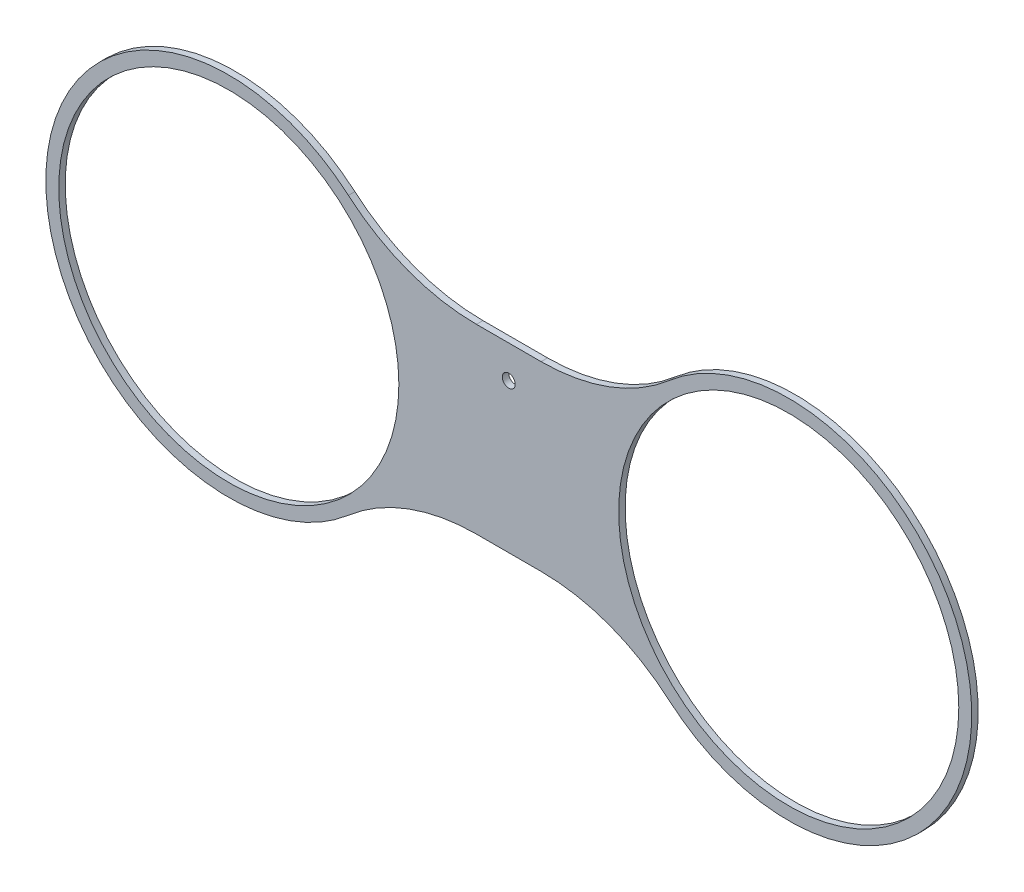
ISO-10303-21;
HEADER;
FILE_DESCRIPTION(('STEP AP214'),'2;1');
FILE_NAME('part.step','',(''),(''),'','','');
FILE_SCHEMA(('AUTOMOTIVE_DESIGN { 1 0 10303 214 1 1 1 1 }'));
ENDSEC;
DATA;
#1=APPLICATION_CONTEXT('core data for automotive mechanical design processes');
#2=APPLICATION_PROTOCOL_DEFINITION('international standard','automotive_design',2000,#1);
#3=PRODUCT_CONTEXT('',#1,'mechanical');
#4=PRODUCT('Part','Part','',(#3));
#5=PRODUCT_RELATED_PRODUCT_CATEGORY('part','',(#4));
#6=PRODUCT_DEFINITION_FORMATION('','',#4);
#7=PRODUCT_DEFINITION_CONTEXT('part definition',#1,'design');
#8=PRODUCT_DEFINITION('design','',#6,#7);
#9=PRODUCT_DEFINITION_SHAPE('','',#8);
#10=(LENGTH_UNIT() NAMED_UNIT(*) SI_UNIT(.MILLI.,.METRE.));
#11=(NAMED_UNIT(*) PLANE_ANGLE_UNIT() SI_UNIT($,.RADIAN.));
#12=(NAMED_UNIT(*) SI_UNIT($,.STERADIAN.) SOLID_ANGLE_UNIT());
#13=UNCERTAINTY_MEASURE_WITH_UNIT(LENGTH_MEASURE(1.E-05),#10,'distance_accuracy_value','');
#14=(GEOMETRIC_REPRESENTATION_CONTEXT(3) GLOBAL_UNCERTAINTY_ASSIGNED_CONTEXT((#13)) GLOBAL_UNIT_ASSIGNED_CONTEXT((#10,
#11,#12)) REPRESENTATION_CONTEXT('',''));
#15=CARTESIAN_POINT('',(0.,0.,0.));
#16=DIRECTION('',(0.,0.,1.));
#17=DIRECTION('',(1.,0.,0.));
#18=AXIS2_PLACEMENT_3D('',#15,#16,#17);
#19=CARTESIAN_POINT('',(15.8526007747352,-140.742861720747,3.175));
#20=DIRECTION('',(0.,0.,1.));
#21=DIRECTION('',(1.,0.,0.));
#22=AXIS2_PLACEMENT_3D('',#19,#20,#21);
#23=PLANE('',#22);
#24=CARTESIAN_POINT('',(-137.421087546888,0.,3.175));
#25=DIRECTION('',(0.,0.,1.));
#26=DIRECTION('',(1.,0.,0.));
#27=AXIS2_PLACEMENT_3D('',#24,#25,#26);
#28=CIRCLE('',#27,83.4771);
#29=CARTESIAN_POINT('',(-53.9439875468881,0.,3.175));
#30=VERTEX_POINT('',#29);
#31=EDGE_CURVE('E181',#30,#30,#28,.T.);
#32=ORIENTED_EDGE('',*,*,#31,.F.);
#33=EDGE_LOOP('',(#32));
#34=FACE_BOUND('',#33,.T.);
#35=CARTESIAN_POINT('',(15.8526007747352,-140.742861720747,3.175));
#36=DIRECTION('',(0.,0.,-1.));
#37=DIRECTION('',(1.,0.,0.));
#38=AXIS2_PLACEMENT_3D('',#35,#36,#37);
#39=CIRCLE('',#38,96.148519688986);
#40=CARTESIAN_POINT('',(15.8526007747352,-44.5943420317607,3.175));
#41=VERTEX_POINT('',#40);
#42=CARTESIAN_POINT('',(78.7018324643302,-67.9794649170588,3.175));
#43=VERTEX_POINT('',#42);
#44=EDGE_CURVE('E144',#41,#43,#39,.T.);
#45=ORIENTED_EDGE('',*,*,#44,.T.);
#46=CARTESIAN_POINT('',(137.418953,0.,3.175));
#47=DIRECTION('',(0.,0.,1.));
#48=DIRECTION('',(1.,0.,0.));
#49=AXIS2_PLACEMENT_3D('',#46,#47,#48);
#50=CIRCLE('',#49,89.8271);
#51=CARTESIAN_POINT('',(78.7018324643302,67.9794649170588,3.175));
#52=VERTEX_POINT('',#51);
#53=EDGE_CURVE('E92',#43,#52,#50,.T.);
#54=ORIENTED_EDGE('',*,*,#53,.T.);
#55=CARTESIAN_POINT('',(15.8526007747352,140.742861720747,3.175));
#56=DIRECTION('',(0.,0.,-1.));
#57=DIRECTION('',(-1.,0.,0.));
#58=AXIS2_PLACEMENT_3D('',#55,#56,#57);
#59=CIRCLE('',#58,96.1485196889861);
#60=CARTESIAN_POINT('',(15.8526007747352,44.5943420317607,3.175));
#61=VERTEX_POINT('',#60);
#62=EDGE_CURVE('E159',#52,#61,#59,.T.);
#63=ORIENTED_EDGE('',*,*,#62,.T.);
#64=DIRECTION('',(-1.,0.,0.));
#65=VECTOR('',#64,1.);
#66=CARTESIAN_POINT('',(15.8526007747352,44.5943420317607,3.175));
#67=LINE('',#66,#65);
#68=CARTESIAN_POINT('',(-15.8547353216234,44.5943420317607,3.175));
#69=VERTEX_POINT('',#68);
#70=EDGE_CURVE('E172',#61,#69,#67,.T.);
#71=ORIENTED_EDGE('',*,*,#70,.T.);
#72=CARTESIAN_POINT('',(-15.8547353216234,140.742861720747,3.175));
#73=DIRECTION('',(0.,0.,-1.));
#74=DIRECTION('',(1.,0.,0.));
#75=AXIS2_PLACEMENT_3D('',#72,#73,#74);
#76=CIRCLE('',#75,96.1485196889861);
#77=CARTESIAN_POINT('',(-78.7039670112184,67.9794649170588,3.175));
#78=VERTEX_POINT('',#77);
#79=EDGE_CURVE('E111',#69,#78,#76,.T.);
#80=ORIENTED_EDGE('',*,*,#79,.T.);
#81=CARTESIAN_POINT('',(-137.421087546888,0.,3.175));
#82=DIRECTION('',(0.,0.,1.));
#83=DIRECTION('',(-1.,0.,0.));
#84=AXIS2_PLACEMENT_3D('',#81,#82,#83);
#85=CIRCLE('',#84,89.8271);
#86=CARTESIAN_POINT('',(-78.7039670112183,-67.9794649170587,3.175));
#87=VERTEX_POINT('',#86);
#88=EDGE_CURVE('E105',#78,#87,#85,.T.);
#89=ORIENTED_EDGE('',*,*,#88,.T.);
#90=CARTESIAN_POINT('',(-15.8547353216234,-140.742861720747,3.175));
#91=DIRECTION('',(0.,0.,-1.));
#92=DIRECTION('',(-1.,0.,0.));
#93=AXIS2_PLACEMENT_3D('',#90,#91,#92);
#94=CIRCLE('',#93,96.148519688986);
#95=CARTESIAN_POINT('',(-15.8547353216234,-44.5943420317607,3.175));
#96=VERTEX_POINT('',#95);
#97=EDGE_CURVE('E109',#87,#96,#94,.T.);
#98=ORIENTED_EDGE('',*,*,#97,.T.);
#99=DIRECTION('',(1.,0.,0.));
#100=VECTOR('',#99,1.);
#101=CARTESIAN_POINT('',(-15.8547353216234,-44.5943420317607,3.175));
#102=LINE('',#101,#100);
#103=EDGE_CURVE('E49',#96,#41,#102,.T.);
#104=ORIENTED_EDGE('',*,*,#103,.T.);
#105=EDGE_LOOP('',(#45,#54,#63,#71,#80,#89,#98,#104));
#106=FACE_BOUND('',#105,.T.);
#107=CARTESIAN_POINT('',(137.418953,0.,3.175));
#108=DIRECTION('',(0.,0.,1.));
#109=DIRECTION('',(1.,0.,0.));
#110=AXIS2_PLACEMENT_3D('',#107,#108,#109);
#111=CIRCLE('',#110,83.4771);
#112=CARTESIAN_POINT('',(220.896053,0.,3.175));
#113=VERTEX_POINT('',#112);
#114=EDGE_CURVE('E133',#113,#113,#111,.T.);
#115=ORIENTED_EDGE('',*,*,#114,.F.);
#116=EDGE_LOOP('',(#115));
#117=FACE_BOUND('',#116,.T.);
#118=CARTESIAN_POINT('',(0.,28.5750000355531,3.175));
#119=DIRECTION('',(0.,0.,1.));
#120=DIRECTION('',(1.,0.,0.));
#121=AXIS2_PLACEMENT_3D('',#118,#119,#120);
#122=CIRCLE('',#121,3.175);
#123=CARTESIAN_POINT('',(3.175,28.5750000355531,3.175));
#124=VERTEX_POINT('',#123);
#125=EDGE_CURVE('E187',#124,#124,#122,.T.);
#126=ORIENTED_EDGE('',*,*,#125,.F.);
#127=EDGE_LOOP('',(#126));
#128=FACE_BOUND('',#127,.T.);
#129=ADVANCED_FACE('F32',(#34,#106,#117,#128),#23,.T.);
#130=CARTESIAN_POINT('',(15.8526007747352,-140.742861720747,0.));
#131=DIRECTION('',(0.,0.,1.));
#132=DIRECTION('',(1.,0.,0.));
#133=AXIS2_PLACEMENT_3D('',#130,#131,#132);
#134=PLANE('',#133);
#135=CARTESIAN_POINT('',(15.8526007747352,-140.742861720747,0.));
#136=DIRECTION('',(0.,0.,-1.));
#137=DIRECTION('',(1.,0.,0.));
#138=AXIS2_PLACEMENT_3D('',#135,#136,#137);
#139=CIRCLE('',#138,96.148519688986);
#140=CARTESIAN_POINT('',(15.8526007747352,-44.5943420317607,0.));
#141=VERTEX_POINT('',#140);
#142=CARTESIAN_POINT('',(78.7018324643302,-67.9794649170588,0.));
#143=VERTEX_POINT('',#142);
#144=EDGE_CURVE('E129',#141,#143,#139,.T.);
#145=ORIENTED_EDGE('',*,*,#144,.F.);
#146=DIRECTION('',(1.,0.,0.));
#147=VECTOR('',#146,1.);
#148=CARTESIAN_POINT('',(-15.8547353216234,-44.5943420317607,0.));
#149=LINE('',#148,#147);
#150=CARTESIAN_POINT('',(-15.8547353216234,-44.5943420317607,0.));
#151=VERTEX_POINT('',#150);
#152=EDGE_CURVE('E84',#151,#141,#149,.T.);
#153=ORIENTED_EDGE('',*,*,#152,.F.);
#154=CARTESIAN_POINT('',(-15.8547353216234,-140.742861720747,0.));
#155=DIRECTION('',(0.,0.,-1.));
#156=DIRECTION('',(-1.,0.,0.));
#157=AXIS2_PLACEMENT_3D('',#154,#155,#156);
#158=CIRCLE('',#157,96.148519688986);
#159=CARTESIAN_POINT('',(-78.7039670112183,-67.9794649170587,0.));
#160=VERTEX_POINT('',#159);
#161=EDGE_CURVE('E78',#160,#151,#158,.T.);
#162=ORIENTED_EDGE('',*,*,#161,.F.);
#163=CARTESIAN_POINT('',(-137.421087546888,0.,0.));
#164=DIRECTION('',(0.,0.,1.));
#165=DIRECTION('',(-1.,0.,0.));
#166=AXIS2_PLACEMENT_3D('',#163,#164,#165);
#167=CIRCLE('',#166,89.8271);
#168=CARTESIAN_POINT('',(-78.7039670112184,67.9794649170588,0.));
#169=VERTEX_POINT('',#168);
#170=EDGE_CURVE('E119',#169,#160,#167,.T.);
#171=ORIENTED_EDGE('',*,*,#170,.F.);
#172=CARTESIAN_POINT('',(-15.8547353216234,140.742861720747,0.));
#173=DIRECTION('',(0.,0.,-1.));
#174=DIRECTION('',(1.,0.,0.));
#175=AXIS2_PLACEMENT_3D('',#172,#173,#174);
#176=CIRCLE('',#175,96.1485196889861);
#177=CARTESIAN_POINT('',(-15.8547353216234,44.5943420317607,0.));
#178=VERTEX_POINT('',#177);
#179=EDGE_CURVE('E139',#178,#169,#176,.T.);
#180=ORIENTED_EDGE('',*,*,#179,.F.);
#181=DIRECTION('',(-1.,0.,0.));
#182=VECTOR('',#181,1.);
#183=CARTESIAN_POINT('',(15.8526007747352,44.5943420317607,0.));
#184=LINE('',#183,#182);
#185=CARTESIAN_POINT('',(15.8526007747352,44.5943420317607,0.));
#186=VERTEX_POINT('',#185);
#187=EDGE_CURVE('E137',#186,#178,#184,.T.);
#188=ORIENTED_EDGE('',*,*,#187,.F.);
#189=CARTESIAN_POINT('',(15.8526007747352,140.742861720747,0.));
#190=DIRECTION('',(0.,0.,-1.));
#191=DIRECTION('',(-1.,0.,0.));
#192=AXIS2_PLACEMENT_3D('',#189,#190,#191);
#193=CIRCLE('',#192,96.1485196889861);
#194=CARTESIAN_POINT('',(78.7018324643302,67.9794649170588,0.));
#195=VERTEX_POINT('',#194);
#196=EDGE_CURVE('E135',#195,#186,#193,.T.);
#197=ORIENTED_EDGE('',*,*,#196,.F.);
#198=CARTESIAN_POINT('',(137.418953,0.,0.));
#199=DIRECTION('',(0.,0.,1.));
#200=DIRECTION('',(1.,0.,0.));
#201=AXIS2_PLACEMENT_3D('',#198,#199,#200);
#202=CIRCLE('',#201,89.8271);
#203=EDGE_CURVE('E132',#143,#195,#202,.T.);
#204=ORIENTED_EDGE('',*,*,#203,.F.);
#205=EDGE_LOOP('',(#145,#153,#162,#171,#180,#188,#197,#204));
#206=FACE_BOUND('',#205,.T.);
#207=CARTESIAN_POINT('',(137.418953,0.,0.));
#208=DIRECTION('',(0.,0.,1.));
#209=DIRECTION('',(1.,0.,0.));
#210=AXIS2_PLACEMENT_3D('',#207,#208,#209);
#211=CIRCLE('',#210,83.4771);
#212=CARTESIAN_POINT('',(220.896053,0.,0.));
#213=VERTEX_POINT('',#212);
#214=EDGE_CURVE('E178',#213,#213,#211,.T.);
#215=ORIENTED_EDGE('',*,*,#214,.T.);
#216=EDGE_LOOP('',(#215));
#217=FACE_BOUND('',#216,.T.);
#218=CARTESIAN_POINT('',(-137.421087546888,0.,0.));
#219=DIRECTION('',(0.,0.,1.));
#220=DIRECTION('',(1.,0.,0.));
#221=AXIS2_PLACEMENT_3D('',#218,#219,#220);
#222=CIRCLE('',#221,83.4771);
#223=CARTESIAN_POINT('',(-53.9439875468881,0.,0.));
#224=VERTEX_POINT('',#223);
#225=EDGE_CURVE('E184',#224,#224,#222,.T.);
#226=ORIENTED_EDGE('',*,*,#225,.T.);
#227=EDGE_LOOP('',(#226));
#228=FACE_BOUND('',#227,.T.);
#229=CARTESIAN_POINT('',(0.,28.5750000355531,0.));
#230=DIRECTION('',(0.,0.,1.));
#231=DIRECTION('',(1.,0.,0.));
#232=AXIS2_PLACEMENT_3D('',#229,#230,#231);
#233=CIRCLE('',#232,3.175);
#234=CARTESIAN_POINT('',(3.175,28.5750000355531,0.));
#235=VERTEX_POINT('',#234);
#236=EDGE_CURVE('E190',#235,#235,#233,.T.);
#237=ORIENTED_EDGE('',*,*,#236,.T.);
#238=EDGE_LOOP('',(#237));
#239=FACE_BOUND('',#238,.T.);
#240=ADVANCED_FACE('F163',(#206,#217,#228,#239),#134,.F.);
#241=CARTESIAN_POINT('',(15.8526007747352,-140.742861720747,3.175));
#242=DIRECTION('',(0.,0.,-1.));
#243=DIRECTION('',(-1.,0.,0.));
#244=AXIS2_PLACEMENT_3D('',#241,#242,#243);
#245=CYLINDRICAL_SURFACE('',#244,96.148519688986);
#246=ORIENTED_EDGE('',*,*,#144,.T.);
#247=DIRECTION('',(0.,0.,-1.));
#248=VECTOR('',#247,1.);
#249=CARTESIAN_POINT('',(78.7018324643302,-67.9794649170588,3.175));
#250=LINE('',#249,#248);
#251=EDGE_CURVE('E11',#43,#143,#250,.T.);
#252=ORIENTED_EDGE('',*,*,#251,.F.);
#253=ORIENTED_EDGE('',*,*,#44,.F.);
#254=DIRECTION('',(0.,0.,-1.));
#255=VECTOR('',#254,1.);
#256=CARTESIAN_POINT('',(15.8526007747352,-44.5943420317607,3.175));
#257=LINE('',#256,#255);
#258=EDGE_CURVE('E125',#41,#141,#257,.T.);
#259=ORIENTED_EDGE('',*,*,#258,.T.);
#260=EDGE_LOOP('',(#246,#252,#253,#259));
#261=FACE_BOUND('',#260,.T.);
#262=ADVANCED_FACE('F34',(#261),#245,.F.);
#263=CARTESIAN_POINT('',(137.418953,0.,3.175));
#264=DIRECTION('',(0.,0.,-1.));
#265=DIRECTION('',(-1.,0.,0.));
#266=AXIS2_PLACEMENT_3D('',#263,#264,#265);
#267=CYLINDRICAL_SURFACE('',#266,89.8271);
#268=ORIENTED_EDGE('',*,*,#203,.T.);
#269=DIRECTION('',(0.,0.,-1.));
#270=VECTOR('',#269,1.);
#271=CARTESIAN_POINT('',(78.7018324643302,67.9794649170588,3.175));
#272=LINE('',#271,#270);
#273=EDGE_CURVE('E41',#52,#195,#272,.T.);
#274=ORIENTED_EDGE('',*,*,#273,.F.);
#275=ORIENTED_EDGE('',*,*,#53,.F.);
#276=ORIENTED_EDGE('',*,*,#251,.T.);
#277=EDGE_LOOP('',(#268,#274,#275,#276));
#278=FACE_BOUND('',#277,.T.);
#279=ADVANCED_FACE('F223',(#278),#267,.T.);
#280=CARTESIAN_POINT('',(15.8526007747352,140.742861720747,3.175));
#281=DIRECTION('',(0.,0.,-1.));
#282=DIRECTION('',(-1.,0.,0.));
#283=AXIS2_PLACEMENT_3D('',#280,#281,#282);
#284=CYLINDRICAL_SURFACE('',#283,96.1485196889861);
#285=ORIENTED_EDGE('',*,*,#196,.T.);
#286=DIRECTION('',(0.,0.,-1.));
#287=VECTOR('',#286,1.);
#288=CARTESIAN_POINT('',(15.8526007747352,44.5943420317607,3.175));
#289=LINE('',#288,#287);
#290=EDGE_CURVE('E151',#61,#186,#289,.T.);
#291=ORIENTED_EDGE('',*,*,#290,.F.);
#292=ORIENTED_EDGE('',*,*,#62,.F.);
#293=ORIENTED_EDGE('',*,*,#273,.T.);
#294=EDGE_LOOP('',(#285,#291,#292,#293));
#295=FACE_BOUND('',#294,.T.);
#296=ADVANCED_FACE('F157',(#295),#284,.F.);
#297=CARTESIAN_POINT('',(15.8526007747352,44.5943420317607,3.175));
#298=DIRECTION('',(0.,-1.,0.));
#299=DIRECTION('',(0.,0.,-1.));
#300=AXIS2_PLACEMENT_3D('',#297,#298,#299);
#301=PLANE('',#300);
#302=ORIENTED_EDGE('',*,*,#187,.T.);
#303=DIRECTION('',(0.,0.,-1.));
#304=VECTOR('',#303,1.);
#305=CARTESIAN_POINT('',(-15.8547353216234,44.5943420317607,3.175));
#306=LINE('',#305,#304);
#307=EDGE_CURVE('E148',#69,#178,#306,.T.);
#308=ORIENTED_EDGE('',*,*,#307,.F.);
#309=ORIENTED_EDGE('',*,*,#70,.F.);
#310=ORIENTED_EDGE('',*,*,#290,.T.);
#311=EDGE_LOOP('',(#302,#308,#309,#310));
#312=FACE_BOUND('',#311,.T.);
#313=ADVANCED_FACE('F168',(#312),#301,.F.);
#314=CARTESIAN_POINT('',(-15.8547353216234,140.742861720747,3.175));
#315=DIRECTION('',(0.,0.,-1.));
#316=DIRECTION('',(-1.,0.,0.));
#317=AXIS2_PLACEMENT_3D('',#314,#315,#316);
#318=CYLINDRICAL_SURFACE('',#317,96.1485196889861);
#319=ORIENTED_EDGE('',*,*,#179,.T.);
#320=DIRECTION('',(0.,0.,-1.));
#321=VECTOR('',#320,1.);
#322=CARTESIAN_POINT('',(-78.7039670112184,67.9794649170588,3.175));
#323=LINE('',#322,#321);
#324=EDGE_CURVE('E120',#78,#169,#323,.T.);
#325=ORIENTED_EDGE('',*,*,#324,.F.);
#326=ORIENTED_EDGE('',*,*,#79,.F.);
#327=ORIENTED_EDGE('',*,*,#307,.T.);
#328=EDGE_LOOP('',(#319,#325,#326,#327));
#329=FACE_BOUND('',#328,.T.);
#330=ADVANCED_FACE('F171',(#329),#318,.F.);
#331=CARTESIAN_POINT('',(-137.421087546888,0.,3.175));
#332=DIRECTION('',(0.,0.,-1.));
#333=DIRECTION('',(-1.,0.,0.));
#334=AXIS2_PLACEMENT_3D('',#331,#332,#333);
#335=CYLINDRICAL_SURFACE('',#334,89.8271);
#336=ORIENTED_EDGE('',*,*,#170,.T.);
#337=DIRECTION('',(0.,0.,-1.));
#338=VECTOR('',#337,1.);
#339=CARTESIAN_POINT('',(-78.7039670112183,-67.9794649170587,3.175));
#340=LINE('',#339,#338);
#341=EDGE_CURVE('E116',#87,#160,#340,.T.);
#342=ORIENTED_EDGE('',*,*,#341,.F.);
#343=ORIENTED_EDGE('',*,*,#88,.F.);
#344=ORIENTED_EDGE('',*,*,#324,.T.);
#345=EDGE_LOOP('',(#336,#342,#343,#344));
#346=FACE_BOUND('',#345,.T.);
#347=ADVANCED_FACE('F117',(#346),#335,.T.);
#348=CARTESIAN_POINT('',(-15.8547353216234,-140.742861720747,3.175));
#349=DIRECTION('',(0.,0.,-1.));
#350=DIRECTION('',(-1.,0.,0.));
#351=AXIS2_PLACEMENT_3D('',#348,#349,#350);
#352=CYLINDRICAL_SURFACE('',#351,96.148519688986);
#353=ORIENTED_EDGE('',*,*,#161,.T.);
#354=DIRECTION('',(0.,0.,-1.));
#355=VECTOR('',#354,1.);
#356=CARTESIAN_POINT('',(-15.8547353216234,-44.5943420317607,3.175));
#357=LINE('',#356,#355);
#358=EDGE_CURVE('E121',#96,#151,#357,.T.);
#359=ORIENTED_EDGE('',*,*,#358,.F.);
#360=ORIENTED_EDGE('',*,*,#97,.F.);
#361=ORIENTED_EDGE('',*,*,#341,.T.);
#362=EDGE_LOOP('',(#353,#359,#360,#361));
#363=FACE_BOUND('',#362,.T.);
#364=ADVANCED_FACE('F123',(#363),#352,.F.);
#365=CARTESIAN_POINT('',(-15.8547353216234,-44.5943420317607,3.175));
#366=DIRECTION('',(0.,1.,0.));
#367=DIRECTION('',(0.,0.,1.));
#368=AXIS2_PLACEMENT_3D('',#365,#366,#367);
#369=PLANE('',#368);
#370=ORIENTED_EDGE('',*,*,#152,.T.);
#371=ORIENTED_EDGE('',*,*,#258,.F.);
#372=ORIENTED_EDGE('',*,*,#103,.F.);
#373=ORIENTED_EDGE('',*,*,#358,.T.);
#374=EDGE_LOOP('',(#370,#371,#372,#373));
#375=FACE_BOUND('',#374,.T.);
#376=ADVANCED_FACE('F211',(#375),#369,.F.);
#377=CARTESIAN_POINT('',(137.418953,0.,3.175));
#378=DIRECTION('',(0.,0.,-1.));
#379=DIRECTION('',(-1.,0.,0.));
#380=AXIS2_PLACEMENT_3D('',#377,#378,#379);
#381=CYLINDRICAL_SURFACE('',#380,83.4771);
#382=ORIENTED_EDGE('',*,*,#114,.T.);
#383=EDGE_LOOP('',(#382));
#384=FACE_BOUND('',#383,.T.);
#385=ORIENTED_EDGE('',*,*,#214,.F.);
#386=EDGE_LOOP('',(#385));
#387=FACE_BOUND('',#386,.T.);
#388=ADVANCED_FACE('F208',(#384,#387),#381,.F.);
#389=CARTESIAN_POINT('',(-137.421087546888,0.,3.175));
#390=DIRECTION('',(0.,0.,-1.));
#391=DIRECTION('',(-1.,0.,0.));
#392=AXIS2_PLACEMENT_3D('',#389,#390,#391);
#393=CYLINDRICAL_SURFACE('',#392,83.4771);
#394=ORIENTED_EDGE('',*,*,#31,.T.);
#395=EDGE_LOOP('',(#394));
#396=FACE_BOUND('',#395,.T.);
#397=ORIENTED_EDGE('',*,*,#225,.F.);
#398=EDGE_LOOP('',(#397));
#399=FACE_BOUND('',#398,.T.);
#400=ADVANCED_FACE('F287',(#396,#399),#393,.F.);
#401=CARTESIAN_POINT('',(0.,28.5750000355531,3.175));
#402=DIRECTION('',(0.,0.,-1.));
#403=DIRECTION('',(-1.,0.,0.));
#404=AXIS2_PLACEMENT_3D('',#401,#402,#403);
#405=CYLINDRICAL_SURFACE('',#404,3.175);
#406=ORIENTED_EDGE('',*,*,#125,.T.);
#407=EDGE_LOOP('',(#406));
#408=FACE_BOUND('',#407,.T.);
#409=ORIENTED_EDGE('',*,*,#236,.F.);
#410=EDGE_LOOP('',(#409));
#411=FACE_BOUND('',#410,.T.);
#412=ADVANCED_FACE('F196',(#408,#411),#405,.F.);
#413=CLOSED_SHELL('',(#129,#240,#262,#279,#296,#313,#330,#347,#364,#376,#388,#400,#412));
#414=MANIFOLD_SOLID_BREP('B2',#413);
#415=ADVANCED_BREP_SHAPE_REPRESENTATION('',(#18,#414),#14);
#416=SHAPE_DEFINITION_REPRESENTATION(#9,#415);
ENDSEC;
END-ISO-10303-21;
